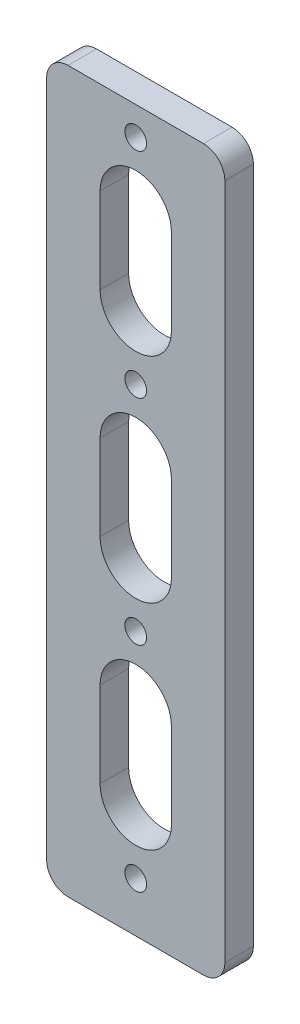
ISO-10303-21;
HEADER;
FILE_DESCRIPTION(('STEP AP214'),'2;1');
FILE_NAME('part.step','',(''),(''),'','','');
FILE_SCHEMA(('AUTOMOTIVE_DESIGN { 1 0 10303 214 1 1 1 1 }'));
ENDSEC;
DATA;
#1=APPLICATION_CONTEXT('core data for automotive mechanical design processes');
#2=APPLICATION_PROTOCOL_DEFINITION('international standard','automotive_design',2000,#1);
#3=PRODUCT_CONTEXT('',#1,'mechanical');
#4=PRODUCT('Part','Part','',(#3));
#5=PRODUCT_RELATED_PRODUCT_CATEGORY('part','',(#4));
#6=PRODUCT_DEFINITION_FORMATION('','',#4);
#7=PRODUCT_DEFINITION_CONTEXT('part definition',#1,'design');
#8=PRODUCT_DEFINITION('design','',#6,#7);
#9=PRODUCT_DEFINITION_SHAPE('','',#8);
#10=(LENGTH_UNIT() NAMED_UNIT(*) SI_UNIT(.MILLI.,.METRE.));
#11=(NAMED_UNIT(*) PLANE_ANGLE_UNIT() SI_UNIT($,.RADIAN.));
#12=(NAMED_UNIT(*) SI_UNIT($,.STERADIAN.) SOLID_ANGLE_UNIT());
#13=UNCERTAINTY_MEASURE_WITH_UNIT(LENGTH_MEASURE(1.E-05),#10,'distance_accuracy_value','');
#14=(GEOMETRIC_REPRESENTATION_CONTEXT(3) GLOBAL_UNCERTAINTY_ASSIGNED_CONTEXT((#13)) GLOBAL_UNIT_ASSIGNED_CONTEXT((#10,
#11,#12)) REPRESENTATION_CONTEXT('',''));
#15=CARTESIAN_POINT('',(0.,0.,0.));
#16=DIRECTION('',(0.,0.,1.));
#17=DIRECTION('',(1.,0.,0.));
#18=AXIS2_PLACEMENT_3D('',#15,#16,#17);
#19=CARTESIAN_POINT('',(12.5,-50.5,4.));
#20=DIRECTION('',(-1.,0.,0.));
#21=DIRECTION('',(0.,0.,1.));
#22=AXIS2_PLACEMENT_3D('',#19,#20,#21);
#23=PLANE('',#22);
#24=DIRECTION('',(0.,1.,0.));
#25=VECTOR('',#24,1.);
#26=CARTESIAN_POINT('',(12.5,-50.5,4.));
#27=LINE('',#26,#25);
#28=CARTESIAN_POINT('',(12.5,-47.5,4.));
#29=VERTEX_POINT('',#28);
#30=CARTESIAN_POINT('',(12.5,47.5,4.));
#31=VERTEX_POINT('',#30);
#32=EDGE_CURVE('E298',#29,#31,#27,.T.);
#33=ORIENTED_EDGE('',*,*,#32,.F.);
#34=DIRECTION('',(0.,0.,-1.));
#35=VECTOR('',#34,1.);
#36=CARTESIAN_POINT('',(12.5,-47.5,4.));
#37=LINE('',#36,#35);
#38=CARTESIAN_POINT('',(12.5,-47.5,0.));
#39=VERTEX_POINT('',#38);
#40=EDGE_CURVE('E323',#29,#39,#37,.T.);
#41=ORIENTED_EDGE('',*,*,#40,.T.);
#42=DIRECTION('',(0.,1.,0.));
#43=VECTOR('',#42,1.);
#44=CARTESIAN_POINT('',(12.5,-50.5,0.));
#45=LINE('',#44,#43);
#46=CARTESIAN_POINT('',(12.5,47.5,0.));
#47=VERTEX_POINT('',#46);
#48=EDGE_CURVE('E277',#39,#47,#45,.T.);
#49=ORIENTED_EDGE('',*,*,#48,.T.);
#50=DIRECTION('',(0.,0.,-1.));
#51=VECTOR('',#50,1.);
#52=CARTESIAN_POINT('',(12.5,47.5,4.));
#53=LINE('',#52,#51);
#54=EDGE_CURVE('E311',#47,#31,#53,.F.);
#55=ORIENTED_EDGE('',*,*,#54,.T.);
#56=EDGE_LOOP('',(#33,#41,#49,#55));
#57=FACE_BOUND('',#56,.T.);
#58=ADVANCED_FACE('F36',(#57),#23,.F.);
#59=CARTESIAN_POINT('',(-12.5,50.5,4.));
#60=DIRECTION('',(0.,-1.,0.));
#61=DIRECTION('',(0.,0.,-1.));
#62=AXIS2_PLACEMENT_3D('',#59,#60,#61);
#63=PLANE('',#62);
#64=DIRECTION('',(-1.,0.,0.));
#65=VECTOR('',#64,1.);
#66=CARTESIAN_POINT('',(-12.5,50.5,0.));
#67=LINE('',#66,#65);
#68=CARTESIAN_POINT('',(9.50000000000001,50.5,0.));
#69=VERTEX_POINT('',#68);
#70=CARTESIAN_POINT('',(-9.5,50.5,0.));
#71=VERTEX_POINT('',#70);
#72=EDGE_CURVE('E314',#69,#71,#67,.T.);
#73=ORIENTED_EDGE('',*,*,#72,.T.);
#74=DIRECTION('',(0.,0.,-1.));
#75=VECTOR('',#74,1.);
#76=CARTESIAN_POINT('',(-9.5,50.5,4.));
#77=LINE('',#76,#75);
#78=CARTESIAN_POINT('',(-9.5,50.5,4.));
#79=VERTEX_POINT('',#78);
#80=EDGE_CURVE('E11',#71,#79,#77,.F.);
#81=ORIENTED_EDGE('',*,*,#80,.T.);
#82=DIRECTION('',(-1.,0.,0.));
#83=VECTOR('',#82,1.);
#84=CARTESIAN_POINT('',(-12.5,50.5,4.));
#85=LINE('',#84,#83);
#86=CARTESIAN_POINT('',(9.50000000000001,50.5,4.));
#87=VERTEX_POINT('',#86);
#88=EDGE_CURVE('E301',#87,#79,#85,.T.);
#89=ORIENTED_EDGE('',*,*,#88,.F.);
#90=DIRECTION('',(0.,0.,-1.));
#91=VECTOR('',#90,1.);
#92=CARTESIAN_POINT('',(9.50000000000001,50.5,4.));
#93=LINE('',#92,#91);
#94=EDGE_CURVE('E44',#87,#69,#93,.T.);
#95=ORIENTED_EDGE('',*,*,#94,.T.);
#96=EDGE_LOOP('',(#73,#81,#89,#95));
#97=FACE_BOUND('',#96,.T.);
#98=ADVANCED_FACE('F356',(#97),#63,.F.);
#99=CARTESIAN_POINT('',(-12.5,-50.5,4.));
#100=DIRECTION('',(1.,0.,0.));
#101=DIRECTION('',(0.,0.,-1.));
#102=AXIS2_PLACEMENT_3D('',#99,#100,#101);
#103=PLANE('',#102);
#104=DIRECTION('',(0.,-1.,0.));
#105=VECTOR('',#104,1.);
#106=CARTESIAN_POINT('',(-12.5,-50.5,4.));
#107=LINE('',#106,#105);
#108=CARTESIAN_POINT('',(-12.5,47.5,4.));
#109=VERTEX_POINT('',#108);
#110=CARTESIAN_POINT('',(-12.5,-47.5,4.));
#111=VERTEX_POINT('',#110);
#112=EDGE_CURVE('E305',#109,#111,#107,.T.);
#113=ORIENTED_EDGE('',*,*,#112,.F.);
#114=DIRECTION('',(0.,0.,-1.));
#115=VECTOR('',#114,1.);
#116=CARTESIAN_POINT('',(-12.5,47.5,4.));
#117=LINE('',#116,#115);
#118=CARTESIAN_POINT('',(-12.5,47.5,0.));
#119=VERTEX_POINT('',#118);
#120=EDGE_CURVE('E349',#109,#119,#117,.T.);
#121=ORIENTED_EDGE('',*,*,#120,.T.);
#122=DIRECTION('',(0.,-1.,0.));
#123=VECTOR('',#122,1.);
#124=CARTESIAN_POINT('',(-12.5,-50.5,0.));
#125=LINE('',#124,#123);
#126=CARTESIAN_POINT('',(-12.5,-47.5,0.));
#127=VERTEX_POINT('',#126);
#128=EDGE_CURVE('E317',#119,#127,#125,.T.);
#129=ORIENTED_EDGE('',*,*,#128,.T.);
#130=DIRECTION('',(0.,0.,-1.));
#131=VECTOR('',#130,1.);
#132=CARTESIAN_POINT('',(-12.5,-47.5,4.));
#133=LINE('',#132,#131);
#134=EDGE_CURVE('E347',#127,#111,#133,.F.);
#135=ORIENTED_EDGE('',*,*,#134,.T.);
#136=EDGE_LOOP('',(#113,#121,#129,#135));
#137=FACE_BOUND('',#136,.T.);
#138=ADVANCED_FACE('F369',(#137),#103,.F.);
#139=CARTESIAN_POINT('',(-12.5,-50.5,4.));
#140=DIRECTION('',(0.,1.,0.));
#141=DIRECTION('',(0.,0.,1.));
#142=AXIS2_PLACEMENT_3D('',#139,#140,#141);
#143=PLANE('',#142);
#144=DIRECTION('',(1.,0.,0.));
#145=VECTOR('',#144,1.);
#146=CARTESIAN_POINT('',(-12.5,-50.5,0.));
#147=LINE('',#146,#145);
#148=CARTESIAN_POINT('',(-9.5,-50.5,0.));
#149=VERTEX_POINT('',#148);
#150=CARTESIAN_POINT('',(9.50000000000001,-50.5,0.));
#151=VERTEX_POINT('',#150);
#152=EDGE_CURVE('E302',#149,#151,#147,.T.);
#153=ORIENTED_EDGE('',*,*,#152,.T.);
#154=DIRECTION('',(0.,0.,-1.));
#155=VECTOR('',#154,1.);
#156=CARTESIAN_POINT('',(9.50000000000001,-50.5,4.));
#157=LINE('',#156,#155);
#158=CARTESIAN_POINT('',(9.50000000000001,-50.5,4.));
#159=VERTEX_POINT('',#158);
#160=EDGE_CURVE('E337',#151,#159,#157,.F.);
#161=ORIENTED_EDGE('',*,*,#160,.T.);
#162=DIRECTION('',(1.,0.,0.));
#163=VECTOR('',#162,1.);
#164=CARTESIAN_POINT('',(-12.5,-50.5,4.));
#165=LINE('',#164,#163);
#166=CARTESIAN_POINT('',(-9.5,-50.5,4.));
#167=VERTEX_POINT('',#166);
#168=EDGE_CURVE('E308',#167,#159,#165,.T.);
#169=ORIENTED_EDGE('',*,*,#168,.F.);
#170=DIRECTION('',(0.,0.,-1.));
#171=VECTOR('',#170,1.);
#172=CARTESIAN_POINT('',(-9.5,-50.5,4.));
#173=LINE('',#172,#171);
#174=EDGE_CURVE('E334',#167,#149,#173,.T.);
#175=ORIENTED_EDGE('',*,*,#174,.T.);
#176=EDGE_LOOP('',(#153,#161,#169,#175));
#177=FACE_BOUND('',#176,.T.);
#178=ADVANCED_FACE('F379',(#177),#143,.F.);
#179=CARTESIAN_POINT('',(0.,0.,4.));
#180=DIRECTION('',(0.,0.,-1.));
#181=DIRECTION('',(-1.,0.,0.));
#182=AXIS2_PLACEMENT_3D('',#179,#180,#181);
#183=PLANE('',#182);
#184=DIRECTION('',(0.,1.,0.));
#185=VECTOR('',#184,1.);
#186=CARTESIAN_POINT('',(5.,-34.5000000005128,4.));
#187=LINE('',#186,#185);
#188=CARTESIAN_POINT('',(5.,-34.5000000005128,4.));
#189=VERTEX_POINT('',#188);
#190=CARTESIAN_POINT('',(5.,-22.5000000005128,4.));
#191=VERTEX_POINT('',#190);
#192=EDGE_CURVE('E202',#189,#191,#187,.T.);
#193=ORIENTED_EDGE('',*,*,#192,.F.);
#194=CARTESIAN_POINT('',(0.,-34.5000000005128,4.));
#195=DIRECTION('',(0.,0.,1.));
#196=DIRECTION('',(1.,0.,0.));
#197=AXIS2_PLACEMENT_3D('',#194,#195,#196);
#198=CIRCLE('',#197,5.);
#199=CARTESIAN_POINT('',(-5.,-34.5000000005128,4.));
#200=VERTEX_POINT('',#199);
#201=EDGE_CURVE('E51',#200,#189,#198,.T.);
#202=ORIENTED_EDGE('',*,*,#201,.F.);
#203=DIRECTION('',(0.,-1.,0.));
#204=VECTOR('',#203,1.);
#205=CARTESIAN_POINT('',(-5.,-34.5000000005128,4.));
#206=LINE('',#205,#204);
#207=CARTESIAN_POINT('',(-5.,-22.5000000005128,4.));
#208=VERTEX_POINT('',#207);
#209=EDGE_CURVE('E193',#208,#200,#206,.T.);
#210=ORIENTED_EDGE('',*,*,#209,.F.);
#211=CARTESIAN_POINT('',(0.,-22.5000000005128,4.));
#212=DIRECTION('',(0.,0.,1.));
#213=DIRECTION('',(1.,0.,0.));
#214=AXIS2_PLACEMENT_3D('',#211,#212,#213);
#215=CIRCLE('',#214,5.);
#216=EDGE_CURVE('E196',#191,#208,#215,.T.);
#217=ORIENTED_EDGE('',*,*,#216,.F.);
#218=EDGE_LOOP('',(#193,#202,#210,#217));
#219=FACE_BOUND('',#218,.T.);
#220=DIRECTION('',(0.,1.,0.));
#221=VECTOR('',#220,1.);
#222=CARTESIAN_POINT('',(4.99999999999999,-4.50000000051281,4.));
#223=LINE('',#222,#221);
#224=CARTESIAN_POINT('',(4.99999999999999,-4.50000000051281,4.));
#225=VERTEX_POINT('',#224);
#226=CARTESIAN_POINT('',(5.,7.49999999948719,4.));
#227=VERTEX_POINT('',#226);
#228=EDGE_CURVE('E228',#225,#227,#223,.T.);
#229=ORIENTED_EDGE('',*,*,#228,.F.);
#230=CARTESIAN_POINT('',(0.,-4.50000000051281,4.));
#231=DIRECTION('',(0.,0.,1.));
#232=DIRECTION('',(1.,0.,0.));
#233=AXIS2_PLACEMENT_3D('',#230,#231,#232);
#234=CIRCLE('',#233,4.99999999999999);
#235=CARTESIAN_POINT('',(-4.99999999999999,-4.5000000005128,4.));
#236=VERTEX_POINT('',#235);
#237=EDGE_CURVE('E59',#236,#225,#234,.T.);
#238=ORIENTED_EDGE('',*,*,#237,.F.);
#239=DIRECTION('',(0.,-1.,0.));
#240=VECTOR('',#239,1.);
#241=CARTESIAN_POINT('',(-4.99999999999999,-4.5000000005128,4.));
#242=LINE('',#241,#240);
#243=CARTESIAN_POINT('',(-4.99999999999999,7.49999999948719,4.));
#244=VERTEX_POINT('',#243);
#245=EDGE_CURVE('E217',#244,#236,#242,.T.);
#246=ORIENTED_EDGE('',*,*,#245,.F.);
#247=CARTESIAN_POINT('',(0.,7.49999999948719,4.));
#248=DIRECTION('',(0.,0.,1.));
#249=DIRECTION('',(1.,0.,0.));
#250=AXIS2_PLACEMENT_3D('',#247,#248,#249);
#251=CIRCLE('',#250,4.99999999999999);
#252=EDGE_CURVE('E232',#227,#244,#251,.T.);
#253=ORIENTED_EDGE('',*,*,#252,.F.);
#254=EDGE_LOOP('',(#229,#238,#246,#253));
#255=FACE_BOUND('',#254,.T.);
#256=DIRECTION('',(0.,1.,0.));
#257=VECTOR('',#256,1.);
#258=CARTESIAN_POINT('',(5.,25.4999999994872,4.));
#259=LINE('',#258,#257);
#260=CARTESIAN_POINT('',(5.,25.4999999994872,4.));
#261=VERTEX_POINT('',#260);
#262=CARTESIAN_POINT('',(5.,37.4999999994872,4.));
#263=VERTEX_POINT('',#262);
#264=EDGE_CURVE('E259',#261,#263,#259,.T.);
#265=ORIENTED_EDGE('',*,*,#264,.F.);
#266=CARTESIAN_POINT('',(0.,25.4999999994872,4.));
#267=DIRECTION('',(0.,0.,1.));
#268=DIRECTION('',(1.,0.,0.));
#269=AXIS2_PLACEMENT_3D('',#266,#267,#268);
#270=CIRCLE('',#269,5.);
#271=CARTESIAN_POINT('',(-5.,25.4999999994872,4.));
#272=VERTEX_POINT('',#271);
#273=EDGE_CURVE('E257',#272,#261,#270,.T.);
#274=ORIENTED_EDGE('',*,*,#273,.F.);
#275=DIRECTION('',(0.,-1.,0.));
#276=VECTOR('',#275,1.);
#277=CARTESIAN_POINT('',(-5.,25.4999999994872,4.));
#278=LINE('',#277,#276);
#279=CARTESIAN_POINT('',(-5.,37.4999999994872,4.));
#280=VERTEX_POINT('',#279);
#281=EDGE_CURVE('E247',#280,#272,#278,.T.);
#282=ORIENTED_EDGE('',*,*,#281,.F.);
#283=CARTESIAN_POINT('',(0.,37.4999999994872,4.));
#284=DIRECTION('',(0.,0.,1.));
#285=DIRECTION('',(1.,0.,0.));
#286=AXIS2_PLACEMENT_3D('',#283,#284,#285);
#287=CIRCLE('',#286,5.);
#288=EDGE_CURVE('E262',#263,#280,#287,.T.);
#289=ORIENTED_EDGE('',*,*,#288,.F.);
#290=EDGE_LOOP('',(#265,#274,#282,#289));
#291=FACE_BOUND('',#290,.T.);
#292=CARTESIAN_POINT('',(-2.54758864111428E-12,-43.5000000005128,4.));
#293=DIRECTION('',(0.,0.,-1.));
#294=DIRECTION('',(-1.,0.,0.));
#295=AXIS2_PLACEMENT_3D('',#292,#293,#294);
#296=CIRCLE('',#295,1.52500000048909);
#297=CARTESIAN_POINT('',(-1.52500000049164,-43.5000000005128,4.));
#298=VERTEX_POINT('',#297);
#299=EDGE_CURVE('E274',#298,#298,#296,.T.);
#300=ORIENTED_EDGE('',*,*,#299,.T.);
#301=EDGE_LOOP('',(#300));
#302=FACE_BOUND('',#301,.T.);
#303=CARTESIAN_POINT('',(-2.54438264456998E-12,-13.5000000005128,4.));
#304=DIRECTION('',(0.,0.,-1.));
#305=DIRECTION('',(-1.,0.,0.));
#306=AXIS2_PLACEMENT_3D('',#303,#304,#305);
#307=CIRCLE('',#306,1.5250000004891);
#308=CARTESIAN_POINT('',(-1.52500000049164,-13.5000000005128,4.));
#309=VERTEX_POINT('',#308);
#310=EDGE_CURVE('E281',#309,#309,#307,.T.);
#311=ORIENTED_EDGE('',*,*,#310,.T.);
#312=EDGE_LOOP('',(#311));
#313=FACE_BOUND('',#312,.T.);
#314=CARTESIAN_POINT('',(-2.54117664802568E-12,16.4999999994872,4.));
#315=DIRECTION('',(0.,0.,-1.));
#316=DIRECTION('',(-1.,0.,0.));
#317=AXIS2_PLACEMENT_3D('',#314,#315,#316);
#318=CIRCLE('',#317,1.5250000004891);
#319=CARTESIAN_POINT('',(-1.52500000049164,16.4999999994872,4.));
#320=VERTEX_POINT('',#319);
#321=EDGE_CURVE('E287',#320,#320,#318,.T.);
#322=ORIENTED_EDGE('',*,*,#321,.T.);
#323=EDGE_LOOP('',(#322));
#324=FACE_BOUND('',#323,.T.);
#325=CARTESIAN_POINT('',(-2.53797065148138E-12,46.4999999994872,4.));
#326=DIRECTION('',(0.,0.,-1.));
#327=DIRECTION('',(-1.,0.,0.));
#328=AXIS2_PLACEMENT_3D('',#325,#326,#327);
#329=CIRCLE('',#328,1.52500000048909);
#330=CARTESIAN_POINT('',(-1.52500000049163,46.4999999994872,4.));
#331=VERTEX_POINT('',#330);
#332=EDGE_CURVE('E293',#331,#331,#329,.T.);
#333=ORIENTED_EDGE('',*,*,#332,.T.);
#334=EDGE_LOOP('',(#333));
#335=FACE_BOUND('',#334,.T.);
#336=ORIENTED_EDGE('',*,*,#168,.T.);
#337=CARTESIAN_POINT('',(9.50000000000001,-47.5,4.));
#338=DIRECTION('',(0.,0.,-1.));
#339=DIRECTION('',(-1.,0.,0.));
#340=AXIS2_PLACEMENT_3D('',#337,#338,#339);
#341=CIRCLE('',#340,3.);
#342=EDGE_CURVE('E345',#159,#29,#341,.F.);
#343=ORIENTED_EDGE('',*,*,#342,.T.);
#344=ORIENTED_EDGE('',*,*,#32,.T.);
#345=CARTESIAN_POINT('',(9.50000000000001,47.5,4.));
#346=DIRECTION('',(0.,0.,-1.));
#347=DIRECTION('',(-1.,0.,0.));
#348=AXIS2_PLACEMENT_3D('',#345,#346,#347);
#349=CIRCLE('',#348,3.);
#350=EDGE_CURVE('E341',#31,#87,#349,.F.);
#351=ORIENTED_EDGE('',*,*,#350,.T.);
#352=ORIENTED_EDGE('',*,*,#88,.T.);
#353=CARTESIAN_POINT('',(-9.5,47.5,4.));
#354=DIRECTION('',(0.,0.,-1.));
#355=DIRECTION('',(-1.,0.,0.));
#356=AXIS2_PLACEMENT_3D('',#353,#354,#355);
#357=CIRCLE('',#356,3.);
#358=EDGE_CURVE('E343',#79,#109,#357,.F.);
#359=ORIENTED_EDGE('',*,*,#358,.T.);
#360=ORIENTED_EDGE('',*,*,#112,.T.);
#361=CARTESIAN_POINT('',(-9.5,-47.5,4.));
#362=DIRECTION('',(0.,0.,-1.));
#363=DIRECTION('',(-1.,0.,0.));
#364=AXIS2_PLACEMENT_3D('',#361,#362,#363);
#365=CIRCLE('',#364,3.);
#366=EDGE_CURVE('E339',#111,#167,#365,.F.);
#367=ORIENTED_EDGE('',*,*,#366,.T.);
#368=EDGE_LOOP('',(#336,#343,#344,#351,#352,#359,#360,#367));
#369=FACE_BOUND('',#368,.T.);
#370=ADVANCED_FACE('F373',(#219,#255,#291,#302,#313,#324,#335,#369),#183,.F.);
#371=CARTESIAN_POINT('',(0.,0.,0.));
#372=DIRECTION('',(0.,0.,-1.));
#373=DIRECTION('',(-1.,0.,0.));
#374=AXIS2_PLACEMENT_3D('',#371,#372,#373);
#375=PLANE('',#374);
#376=CARTESIAN_POINT('',(0.,-34.5000000005128,0.));
#377=DIRECTION('',(0.,0.,1.));
#378=DIRECTION('',(1.,0.,0.));
#379=AXIS2_PLACEMENT_3D('',#376,#377,#378);
#380=CIRCLE('',#379,5.);
#381=CARTESIAN_POINT('',(-5.,-34.5000000005128,0.));
#382=VERTEX_POINT('',#381);
#383=CARTESIAN_POINT('',(5.,-34.5000000005128,0.));
#384=VERTEX_POINT('',#383);
#385=EDGE_CURVE('E174',#382,#384,#380,.T.);
#386=ORIENTED_EDGE('',*,*,#385,.T.);
#387=DIRECTION('',(0.,1.,0.));
#388=VECTOR('',#387,1.);
#389=CARTESIAN_POINT('',(5.,-34.5000000005128,0.));
#390=LINE('',#389,#388);
#391=CARTESIAN_POINT('',(4.99999999999999,-22.5000000005128,0.));
#392=VERTEX_POINT('',#391);
#393=EDGE_CURVE('E184',#384,#392,#390,.T.);
#394=ORIENTED_EDGE('',*,*,#393,.T.);
#395=CARTESIAN_POINT('',(0.,-22.5000000005128,0.));
#396=DIRECTION('',(0.,0.,1.));
#397=DIRECTION('',(1.,0.,0.));
#398=AXIS2_PLACEMENT_3D('',#395,#396,#397);
#399=CIRCLE('',#398,5.);
#400=CARTESIAN_POINT('',(-5.,-22.5000000005128,0.));
#401=VERTEX_POINT('',#400);
#402=EDGE_CURVE('E188',#392,#401,#399,.T.);
#403=ORIENTED_EDGE('',*,*,#402,.T.);
#404=DIRECTION('',(0.,-1.,0.));
#405=VECTOR('',#404,1.);
#406=CARTESIAN_POINT('',(-5.,-34.5000000005128,0.));
#407=LINE('',#406,#405);
#408=EDGE_CURVE('E180',#401,#382,#407,.T.);
#409=ORIENTED_EDGE('',*,*,#408,.T.);
#410=EDGE_LOOP('',(#386,#394,#403,#409));
#411=FACE_BOUND('',#410,.T.);
#412=CARTESIAN_POINT('',(0.,-4.50000000051281,0.));
#413=DIRECTION('',(0.,0.,1.));
#414=DIRECTION('',(1.,0.,0.));
#415=AXIS2_PLACEMENT_3D('',#412,#413,#414);
#416=CIRCLE('',#415,4.99999999999999);
#417=CARTESIAN_POINT('',(-4.99999999999999,-4.5000000005128,0.));
#418=VERTEX_POINT('',#417);
#419=CARTESIAN_POINT('',(4.99999999999999,-4.50000000051281,0.));
#420=VERTEX_POINT('',#419);
#421=EDGE_CURVE('E213',#418,#420,#416,.T.);
#422=ORIENTED_EDGE('',*,*,#421,.T.);
#423=DIRECTION('',(0.,1.,0.));
#424=VECTOR('',#423,1.);
#425=CARTESIAN_POINT('',(4.99999999999999,-4.50000000051281,0.));
#426=LINE('',#425,#424);
#427=CARTESIAN_POINT('',(4.99999999999999,7.49999999948719,0.));
#428=VERTEX_POINT('',#427);
#429=EDGE_CURVE('E216',#420,#428,#426,.T.);
#430=ORIENTED_EDGE('',*,*,#429,.T.);
#431=CARTESIAN_POINT('',(0.,7.49999999948719,0.));
#432=DIRECTION('',(0.,0.,1.));
#433=DIRECTION('',(1.,0.,0.));
#434=AXIS2_PLACEMENT_3D('',#431,#432,#433);
#435=CIRCLE('',#434,4.99999999999999);
#436=CARTESIAN_POINT('',(-4.99999999999999,7.49999999948719,0.));
#437=VERTEX_POINT('',#436);
#438=EDGE_CURVE('E220',#428,#437,#435,.T.);
#439=ORIENTED_EDGE('',*,*,#438,.T.);
#440=DIRECTION('',(0.,-1.,0.));
#441=VECTOR('',#440,1.);
#442=CARTESIAN_POINT('',(-4.99999999999999,-4.5000000005128,0.));
#443=LINE('',#442,#441);
#444=EDGE_CURVE('E223',#437,#418,#443,.T.);
#445=ORIENTED_EDGE('',*,*,#444,.T.);
#446=EDGE_LOOP('',(#422,#430,#439,#445));
#447=FACE_BOUND('',#446,.T.);
#448=CARTESIAN_POINT('',(0.,25.4999999994872,0.));
#449=DIRECTION('',(0.,0.,1.));
#450=DIRECTION('',(1.,0.,0.));
#451=AXIS2_PLACEMENT_3D('',#448,#449,#450);
#452=CIRCLE('',#451,5.);
#453=CARTESIAN_POINT('',(-5.,25.4999999994872,0.));
#454=VERTEX_POINT('',#453);
#455=CARTESIAN_POINT('',(5.,25.4999999994872,0.));
#456=VERTEX_POINT('',#455);
#457=EDGE_CURVE('E243',#454,#456,#452,.T.);
#458=ORIENTED_EDGE('',*,*,#457,.T.);
#459=DIRECTION('',(0.,1.,0.));
#460=VECTOR('',#459,1.);
#461=CARTESIAN_POINT('',(5.,25.4999999994872,0.));
#462=LINE('',#461,#460);
#463=CARTESIAN_POINT('',(5.,37.4999999994872,0.));
#464=VERTEX_POINT('',#463);
#465=EDGE_CURVE('E246',#456,#464,#462,.T.);
#466=ORIENTED_EDGE('',*,*,#465,.T.);
#467=CARTESIAN_POINT('',(0.,37.4999999994872,0.));
#468=DIRECTION('',(0.,0.,1.));
#469=DIRECTION('',(1.,0.,0.));
#470=AXIS2_PLACEMENT_3D('',#467,#468,#469);
#471=CIRCLE('',#470,5.);
#472=CARTESIAN_POINT('',(-5.,37.4999999994872,0.));
#473=VERTEX_POINT('',#472);
#474=EDGE_CURVE('E250',#464,#473,#471,.T.);
#475=ORIENTED_EDGE('',*,*,#474,.T.);
#476=DIRECTION('',(0.,-1.,0.));
#477=VECTOR('',#476,1.);
#478=CARTESIAN_POINT('',(-5.,25.4999999994872,0.));
#479=LINE('',#478,#477);
#480=EDGE_CURVE('E253',#473,#454,#479,.T.);
#481=ORIENTED_EDGE('',*,*,#480,.T.);
#482=EDGE_LOOP('',(#458,#466,#475,#481));
#483=FACE_BOUND('',#482,.T.);
#484=CARTESIAN_POINT('',(-2.54758864111428E-12,-43.5000000005128,0.));
#485=DIRECTION('',(0.,0.,-1.));
#486=DIRECTION('',(-1.,0.,0.));
#487=AXIS2_PLACEMENT_3D('',#484,#485,#486);
#488=CIRCLE('',#487,1.52500000048909);
#489=CARTESIAN_POINT('',(-1.52500000049164,-43.5000000005128,0.));
#490=VERTEX_POINT('',#489);
#491=EDGE_CURVE('E278',#490,#490,#488,.T.);
#492=ORIENTED_EDGE('',*,*,#491,.F.);
#493=EDGE_LOOP('',(#492));
#494=FACE_BOUND('',#493,.T.);
#495=CARTESIAN_POINT('',(-2.54438264456998E-12,-13.5000000005128,0.));
#496=DIRECTION('',(0.,0.,-1.));
#497=DIRECTION('',(-1.,0.,0.));
#498=AXIS2_PLACEMENT_3D('',#495,#496,#497);
#499=CIRCLE('',#498,1.5250000004891);
#500=CARTESIAN_POINT('',(-1.52500000049164,-13.5000000005128,0.));
#501=VERTEX_POINT('',#500);
#502=EDGE_CURVE('E284',#501,#501,#499,.T.);
#503=ORIENTED_EDGE('',*,*,#502,.F.);
#504=EDGE_LOOP('',(#503));
#505=FACE_BOUND('',#504,.T.);
#506=CARTESIAN_POINT('',(-2.54117664802568E-12,16.4999999994872,0.));
#507=DIRECTION('',(0.,0.,-1.));
#508=DIRECTION('',(-1.,0.,0.));
#509=AXIS2_PLACEMENT_3D('',#506,#507,#508);
#510=CIRCLE('',#509,1.5250000004891);
#511=CARTESIAN_POINT('',(-1.52500000049164,16.4999999994872,0.));
#512=VERTEX_POINT('',#511);
#513=EDGE_CURVE('E290',#512,#512,#510,.T.);
#514=ORIENTED_EDGE('',*,*,#513,.F.);
#515=EDGE_LOOP('',(#514));
#516=FACE_BOUND('',#515,.T.);
#517=CARTESIAN_POINT('',(-2.53797065148138E-12,46.4999999994872,0.));
#518=DIRECTION('',(0.,0.,-1.));
#519=DIRECTION('',(-1.,0.,0.));
#520=AXIS2_PLACEMENT_3D('',#517,#518,#519);
#521=CIRCLE('',#520,1.52500000048909);
#522=CARTESIAN_POINT('',(-1.52500000049163,46.4999999994872,0.));
#523=VERTEX_POINT('',#522);
#524=EDGE_CURVE('E209',#523,#523,#521,.T.);
#525=ORIENTED_EDGE('',*,*,#524,.F.);
#526=EDGE_LOOP('',(#525));
#527=FACE_BOUND('',#526,.T.);
#528=ORIENTED_EDGE('',*,*,#48,.F.);
#529=CARTESIAN_POINT('',(9.50000000000001,-47.5,0.));
#530=DIRECTION('',(0.,0.,-1.));
#531=DIRECTION('',(-1.,0.,0.));
#532=AXIS2_PLACEMENT_3D('',#529,#530,#531);
#533=CIRCLE('',#532,3.);
#534=EDGE_CURVE('E332',#39,#151,#533,.T.);
#535=ORIENTED_EDGE('',*,*,#534,.T.);
#536=ORIENTED_EDGE('',*,*,#152,.F.);
#537=CARTESIAN_POINT('',(-9.5,-47.5,0.));
#538=DIRECTION('',(0.,0.,-1.));
#539=DIRECTION('',(-1.,0.,0.));
#540=AXIS2_PLACEMENT_3D('',#537,#538,#539);
#541=CIRCLE('',#540,3.);
#542=EDGE_CURVE('E326',#149,#127,#541,.T.);
#543=ORIENTED_EDGE('',*,*,#542,.T.);
#544=ORIENTED_EDGE('',*,*,#128,.F.);
#545=CARTESIAN_POINT('',(-9.5,47.5,0.));
#546=DIRECTION('',(0.,0.,-1.));
#547=DIRECTION('',(-1.,0.,0.));
#548=AXIS2_PLACEMENT_3D('',#545,#546,#547);
#549=CIRCLE('',#548,3.);
#550=EDGE_CURVE('E330',#119,#71,#549,.T.);
#551=ORIENTED_EDGE('',*,*,#550,.T.);
#552=ORIENTED_EDGE('',*,*,#72,.F.);
#553=CARTESIAN_POINT('',(9.50000000000001,47.5,0.));
#554=DIRECTION('',(0.,0.,-1.));
#555=DIRECTION('',(-1.,0.,0.));
#556=AXIS2_PLACEMENT_3D('',#553,#554,#555);
#557=CIRCLE('',#556,3.);
#558=EDGE_CURVE('E328',#69,#47,#557,.T.);
#559=ORIENTED_EDGE('',*,*,#558,.T.);
#560=EDGE_LOOP('',(#528,#535,#536,#543,#544,#551,#552,#559));
#561=FACE_BOUND('',#560,.T.);
#562=ADVANCED_FACE('F190',(#411,#447,#483,#494,#505,#516,#527,#561),#375,.T.);
#563=CARTESIAN_POINT('',(-2.53797065148138E-12,46.4999999994872,4.));
#564=DIRECTION('',(0.,0.,-1.));
#565=DIRECTION('',(-1.,0.,0.));
#566=AXIS2_PLACEMENT_3D('',#563,#564,#565);
#567=CYLINDRICAL_SURFACE('',#566,1.52500000048909);
#568=ORIENTED_EDGE('',*,*,#332,.F.);
#569=EDGE_LOOP('',(#568));
#570=FACE_BOUND('',#569,.T.);
#571=ORIENTED_EDGE('',*,*,#524,.T.);
#572=EDGE_LOOP('',(#571));
#573=FACE_BOUND('',#572,.T.);
#574=ADVANCED_FACE('F425',(#570,#573),#567,.F.);
#575=CARTESIAN_POINT('',(-2.54117664802568E-12,16.4999999994872,4.));
#576=DIRECTION('',(0.,0.,-1.));
#577=DIRECTION('',(-1.,0.,0.));
#578=AXIS2_PLACEMENT_3D('',#575,#576,#577);
#579=CYLINDRICAL_SURFACE('',#578,1.5250000004891);
#580=ORIENTED_EDGE('',*,*,#321,.F.);
#581=EDGE_LOOP('',(#580));
#582=FACE_BOUND('',#581,.T.);
#583=ORIENTED_EDGE('',*,*,#513,.T.);
#584=EDGE_LOOP('',(#583));
#585=FACE_BOUND('',#584,.T.);
#586=ADVANCED_FACE('F415',(#582,#585),#579,.F.);
#587=CARTESIAN_POINT('',(-2.54438264456998E-12,-13.5000000005128,4.));
#588=DIRECTION('',(0.,0.,-1.));
#589=DIRECTION('',(-1.,0.,0.));
#590=AXIS2_PLACEMENT_3D('',#587,#588,#589);
#591=CYLINDRICAL_SURFACE('',#590,1.5250000004891);
#592=ORIENTED_EDGE('',*,*,#310,.F.);
#593=EDGE_LOOP('',(#592));
#594=FACE_BOUND('',#593,.T.);
#595=ORIENTED_EDGE('',*,*,#502,.T.);
#596=EDGE_LOOP('',(#595));
#597=FACE_BOUND('',#596,.T.);
#598=ADVANCED_FACE('F409',(#594,#597),#591,.F.);
#599=CARTESIAN_POINT('',(-2.54758864111428E-12,-43.5000000005128,4.));
#600=DIRECTION('',(0.,0.,-1.));
#601=DIRECTION('',(-1.,0.,0.));
#602=AXIS2_PLACEMENT_3D('',#599,#600,#601);
#603=CYLINDRICAL_SURFACE('',#602,1.52500000048909);
#604=ORIENTED_EDGE('',*,*,#299,.F.);
#605=EDGE_LOOP('',(#604));
#606=FACE_BOUND('',#605,.T.);
#607=ORIENTED_EDGE('',*,*,#491,.T.);
#608=EDGE_LOOP('',(#607));
#609=FACE_BOUND('',#608,.T.);
#610=ADVANCED_FACE('F405',(#606,#609),#603,.F.);
#611=CARTESIAN_POINT('',(9.50000000000001,-47.5,4.));
#612=DIRECTION('',(0.,0.,-1.));
#613=DIRECTION('',(-1.,0.,0.));
#614=AXIS2_PLACEMENT_3D('',#611,#612,#613);
#615=CYLINDRICAL_SURFACE('',#614,3.);
#616=ORIENTED_EDGE('',*,*,#342,.F.);
#617=ORIENTED_EDGE('',*,*,#160,.F.);
#618=ORIENTED_EDGE('',*,*,#534,.F.);
#619=ORIENTED_EDGE('',*,*,#40,.F.);
#620=EDGE_LOOP('',(#616,#617,#618,#619));
#621=FACE_BOUND('',#620,.T.);
#622=ADVANCED_FACE('F384',(#621),#615,.T.);
#623=CARTESIAN_POINT('',(-9.5,47.5,4.));
#624=DIRECTION('',(0.,0.,-1.));
#625=DIRECTION('',(-1.,0.,0.));
#626=AXIS2_PLACEMENT_3D('',#623,#624,#625);
#627=CYLINDRICAL_SURFACE('',#626,3.);
#628=ORIENTED_EDGE('',*,*,#358,.F.);
#629=ORIENTED_EDGE('',*,*,#80,.F.);
#630=ORIENTED_EDGE('',*,*,#550,.F.);
#631=ORIENTED_EDGE('',*,*,#120,.F.);
#632=EDGE_LOOP('',(#628,#629,#630,#631));
#633=FACE_BOUND('',#632,.T.);
#634=ADVANCED_FACE('F366',(#633),#627,.T.);
#635=CARTESIAN_POINT('',(9.50000000000001,47.5,4.));
#636=DIRECTION('',(0.,0.,-1.));
#637=DIRECTION('',(-1.,0.,0.));
#638=AXIS2_PLACEMENT_3D('',#635,#636,#637);
#639=CYLINDRICAL_SURFACE('',#638,3.);
#640=ORIENTED_EDGE('',*,*,#350,.F.);
#641=ORIENTED_EDGE('',*,*,#54,.F.);
#642=ORIENTED_EDGE('',*,*,#558,.F.);
#643=ORIENTED_EDGE('',*,*,#94,.F.);
#644=EDGE_LOOP('',(#640,#641,#642,#643));
#645=FACE_BOUND('',#644,.T.);
#646=ADVANCED_FACE('F388',(#645),#639,.T.);
#647=CARTESIAN_POINT('',(-9.5,-47.5,4.));
#648=DIRECTION('',(0.,0.,-1.));
#649=DIRECTION('',(-1.,0.,0.));
#650=AXIS2_PLACEMENT_3D('',#647,#648,#649);
#651=CYLINDRICAL_SURFACE('',#650,3.);
#652=ORIENTED_EDGE('',*,*,#366,.F.);
#653=ORIENTED_EDGE('',*,*,#134,.F.);
#654=ORIENTED_EDGE('',*,*,#542,.F.);
#655=ORIENTED_EDGE('',*,*,#174,.F.);
#656=EDGE_LOOP('',(#652,#653,#654,#655));
#657=FACE_BOUND('',#656,.T.);
#658=ADVANCED_FACE('F38',(#657),#651,.T.);
#659=CARTESIAN_POINT('',(0.,25.4999999994872,0.));
#660=DIRECTION('',(0.,0.,1.));
#661=DIRECTION('',(1.,0.,0.));
#662=AXIS2_PLACEMENT_3D('',#659,#660,#661);
#663=CYLINDRICAL_SURFACE('',#662,5.);
#664=ORIENTED_EDGE('',*,*,#273,.T.);
#665=DIRECTION('',(0.,0.,1.));
#666=VECTOR('',#665,1.);
#667=CARTESIAN_POINT('',(5.,25.4999999994872,0.));
#668=LINE('',#667,#666);
#669=EDGE_CURVE('E256',#456,#261,#668,.T.);
#670=ORIENTED_EDGE('',*,*,#669,.F.);
#671=ORIENTED_EDGE('',*,*,#457,.F.);
#672=DIRECTION('',(0.,0.,1.));
#673=VECTOR('',#672,1.);
#674=CARTESIAN_POINT('',(-5.,25.4999999994872,0.));
#675=LINE('',#674,#673);
#676=EDGE_CURVE('E229',#454,#272,#675,.T.);
#677=ORIENTED_EDGE('',*,*,#676,.T.);
#678=EDGE_LOOP('',(#664,#670,#671,#677));
#679=FACE_BOUND('',#678,.T.);
#680=ADVANCED_FACE('F394',(#679),#663,.F.);
#681=CARTESIAN_POINT('',(-5.,25.4999999994872,0.));
#682=DIRECTION('',(-1.,0.,0.));
#683=DIRECTION('',(0.,-1.,0.));
#684=AXIS2_PLACEMENT_3D('',#681,#682,#683);
#685=PLANE('',#684);
#686=ORIENTED_EDGE('',*,*,#281,.T.);
#687=ORIENTED_EDGE('',*,*,#676,.F.);
#688=ORIENTED_EDGE('',*,*,#480,.F.);
#689=DIRECTION('',(0.,0.,1.));
#690=VECTOR('',#689,1.);
#691=CARTESIAN_POINT('',(-5.,37.4999999994872,0.));
#692=LINE('',#691,#690);
#693=EDGE_CURVE('E268',#473,#280,#692,.T.);
#694=ORIENTED_EDGE('',*,*,#693,.T.);
#695=EDGE_LOOP('',(#686,#687,#688,#694));
#696=FACE_BOUND('',#695,.T.);
#697=ADVANCED_FACE('F517',(#696),#685,.F.);
#698=CARTESIAN_POINT('',(0.,37.4999999994872,0.));
#699=DIRECTION('',(0.,0.,1.));
#700=DIRECTION('',(1.,0.,0.));
#701=AXIS2_PLACEMENT_3D('',#698,#699,#700);
#702=CYLINDRICAL_SURFACE('',#701,5.);
#703=ORIENTED_EDGE('',*,*,#288,.T.);
#704=ORIENTED_EDGE('',*,*,#693,.F.);
#705=ORIENTED_EDGE('',*,*,#474,.F.);
#706=DIRECTION('',(0.,0.,1.));
#707=VECTOR('',#706,1.);
#708=CARTESIAN_POINT('',(5.,37.4999999994872,0.));
#709=LINE('',#708,#707);
#710=EDGE_CURVE('E270',#464,#263,#709,.T.);
#711=ORIENTED_EDGE('',*,*,#710,.T.);
#712=EDGE_LOOP('',(#703,#704,#705,#711));
#713=FACE_BOUND('',#712,.T.);
#714=ADVANCED_FACE('F525',(#713),#702,.F.);
#715=CARTESIAN_POINT('',(5.,25.4999999994872,0.));
#716=DIRECTION('',(1.,0.,0.));
#717=DIRECTION('',(0.,1.,0.));
#718=AXIS2_PLACEMENT_3D('',#715,#716,#717);
#719=PLANE('',#718);
#720=ORIENTED_EDGE('',*,*,#264,.T.);
#721=ORIENTED_EDGE('',*,*,#710,.F.);
#722=ORIENTED_EDGE('',*,*,#465,.F.);
#723=ORIENTED_EDGE('',*,*,#669,.T.);
#724=EDGE_LOOP('',(#720,#721,#722,#723));
#725=FACE_BOUND('',#724,.T.);
#726=ADVANCED_FACE('F534',(#725),#719,.F.);
#727=CARTESIAN_POINT('',(0.,-4.50000000051281,0.));
#728=DIRECTION('',(0.,0.,1.));
#729=DIRECTION('',(1.,0.,0.));
#730=AXIS2_PLACEMENT_3D('',#727,#728,#729);
#731=CYLINDRICAL_SURFACE('',#730,4.99999999999999);
#732=ORIENTED_EDGE('',*,*,#237,.T.);
#733=DIRECTION('',(0.,0.,1.));
#734=VECTOR('',#733,1.);
#735=CARTESIAN_POINT('',(4.99999999999999,-4.50000000051281,0.));
#736=LINE('',#735,#734);
#737=EDGE_CURVE('E226',#420,#225,#736,.T.);
#738=ORIENTED_EDGE('',*,*,#737,.F.);
#739=ORIENTED_EDGE('',*,*,#421,.F.);
#740=DIRECTION('',(0.,0.,1.));
#741=VECTOR('',#740,1.);
#742=CARTESIAN_POINT('',(-4.99999999999999,-4.5000000005128,0.));
#743=LINE('',#742,#741);
#744=EDGE_CURVE('E203',#418,#236,#743,.T.);
#745=ORIENTED_EDGE('',*,*,#744,.T.);
#746=EDGE_LOOP('',(#732,#738,#739,#745));
#747=FACE_BOUND('',#746,.T.);
#748=ADVANCED_FACE('F543',(#747),#731,.F.);
#749=CARTESIAN_POINT('',(-4.99999999999999,-4.5000000005128,0.));
#750=DIRECTION('',(-1.,0.,0.));
#751=DIRECTION('',(0.,-1.,0.));
#752=AXIS2_PLACEMENT_3D('',#749,#750,#751);
#753=PLANE('',#752);
#754=ORIENTED_EDGE('',*,*,#245,.T.);
#755=ORIENTED_EDGE('',*,*,#744,.F.);
#756=ORIENTED_EDGE('',*,*,#444,.F.);
#757=DIRECTION('',(0.,0.,1.));
#758=VECTOR('',#757,1.);
#759=CARTESIAN_POINT('',(-4.99999999999999,7.49999999948719,0.));
#760=LINE('',#759,#758);
#761=EDGE_CURVE('E238',#437,#244,#760,.T.);
#762=ORIENTED_EDGE('',*,*,#761,.T.);
#763=EDGE_LOOP('',(#754,#755,#756,#762));
#764=FACE_BOUND('',#763,.T.);
#765=ADVANCED_FACE('F551',(#764),#753,.F.);
#766=CARTESIAN_POINT('',(0.,7.49999999948719,0.));
#767=DIRECTION('',(0.,0.,1.));
#768=DIRECTION('',(1.,0.,0.));
#769=AXIS2_PLACEMENT_3D('',#766,#767,#768);
#770=CYLINDRICAL_SURFACE('',#769,4.99999999999999);
#771=ORIENTED_EDGE('',*,*,#252,.T.);
#772=ORIENTED_EDGE('',*,*,#761,.F.);
#773=ORIENTED_EDGE('',*,*,#438,.F.);
#774=DIRECTION('',(0.,0.,1.));
#775=VECTOR('',#774,1.);
#776=CARTESIAN_POINT('',(5.,7.49999999948719,0.));
#777=LINE('',#776,#775);
#778=EDGE_CURVE('E240',#428,#227,#777,.T.);
#779=ORIENTED_EDGE('',*,*,#778,.T.);
#780=EDGE_LOOP('',(#771,#772,#773,#779));
#781=FACE_BOUND('',#780,.T.);
#782=ADVANCED_FACE('F559',(#781),#770,.F.);
#783=CARTESIAN_POINT('',(4.99999999999999,-4.50000000051281,0.));
#784=DIRECTION('',(1.,0.,0.));
#785=DIRECTION('',(0.,1.,0.));
#786=AXIS2_PLACEMENT_3D('',#783,#784,#785);
#787=PLANE('',#786);
#788=ORIENTED_EDGE('',*,*,#228,.T.);
#789=ORIENTED_EDGE('',*,*,#778,.F.);
#790=ORIENTED_EDGE('',*,*,#429,.F.);
#791=ORIENTED_EDGE('',*,*,#737,.T.);
#792=EDGE_LOOP('',(#788,#789,#790,#791));
#793=FACE_BOUND('',#792,.T.);
#794=ADVANCED_FACE('F568',(#793),#787,.F.);
#795=CARTESIAN_POINT('',(0.,-34.5000000005128,0.));
#796=DIRECTION('',(0.,0.,1.));
#797=DIRECTION('',(1.,0.,0.));
#798=AXIS2_PLACEMENT_3D('',#795,#796,#797);
#799=CYLINDRICAL_SURFACE('',#798,5.);
#800=ORIENTED_EDGE('',*,*,#201,.T.);
#801=DIRECTION('',(0.,0.,1.));
#802=VECTOR('',#801,1.);
#803=CARTESIAN_POINT('',(5.,-34.5000000005128,0.));
#804=LINE('',#803,#802);
#805=EDGE_CURVE('E170',#384,#189,#804,.T.);
#806=ORIENTED_EDGE('',*,*,#805,.F.);
#807=ORIENTED_EDGE('',*,*,#385,.F.);
#808=DIRECTION('',(0.,0.,1.));
#809=VECTOR('',#808,1.);
#810=CARTESIAN_POINT('',(-5.,-34.5000000005128,0.));
#811=LINE('',#810,#809);
#812=EDGE_CURVE('E207',#382,#200,#811,.T.);
#813=ORIENTED_EDGE('',*,*,#812,.T.);
#814=EDGE_LOOP('',(#800,#806,#807,#813));
#815=FACE_BOUND('',#814,.T.);
#816=ADVANCED_FACE('F172',(#815),#799,.F.);
#817=CARTESIAN_POINT('',(-5.,-34.5000000005128,0.));
#818=DIRECTION('',(-1.,0.,0.));
#819=DIRECTION('',(0.,-1.,0.));
#820=AXIS2_PLACEMENT_3D('',#817,#818,#819);
#821=PLANE('',#820);
#822=ORIENTED_EDGE('',*,*,#209,.T.);
#823=ORIENTED_EDGE('',*,*,#812,.F.);
#824=ORIENTED_EDGE('',*,*,#408,.F.);
#825=DIRECTION('',(0.,0.,1.));
#826=VECTOR('',#825,1.);
#827=CARTESIAN_POINT('',(-5.,-22.5000000005128,0.));
#828=LINE('',#827,#826);
#829=EDGE_CURVE('E210',#401,#208,#828,.T.);
#830=ORIENTED_EDGE('',*,*,#829,.T.);
#831=EDGE_LOOP('',(#822,#823,#824,#830));
#832=FACE_BOUND('',#831,.T.);
#833=ADVANCED_FACE('F585',(#832),#821,.F.);
#834=CARTESIAN_POINT('',(0.,-22.5000000005128,0.));
#835=DIRECTION('',(0.,0.,1.));
#836=DIRECTION('',(1.,0.,0.));
#837=AXIS2_PLACEMENT_3D('',#834,#835,#836);
#838=CYLINDRICAL_SURFACE('',#837,5.);
#839=ORIENTED_EDGE('',*,*,#216,.T.);
#840=ORIENTED_EDGE('',*,*,#829,.F.);
#841=ORIENTED_EDGE('',*,*,#402,.F.);
#842=DIRECTION('',(0.,0.,1.));
#843=VECTOR('',#842,1.);
#844=CARTESIAN_POINT('',(5.,-22.5000000005128,0.));
#845=LINE('',#844,#843);
#846=EDGE_CURVE('E179',#392,#191,#845,.T.);
#847=ORIENTED_EDGE('',*,*,#846,.T.);
#848=EDGE_LOOP('',(#839,#840,#841,#847));
#849=FACE_BOUND('',#848,.T.);
#850=ADVANCED_FACE('F593',(#849),#838,.F.);
#851=CARTESIAN_POINT('',(5.,-34.5000000005128,0.));
#852=DIRECTION('',(1.,0.,0.));
#853=DIRECTION('',(0.,1.,0.));
#854=AXIS2_PLACEMENT_3D('',#851,#852,#853);
#855=PLANE('',#854);
#856=ORIENTED_EDGE('',*,*,#192,.T.);
#857=ORIENTED_EDGE('',*,*,#846,.F.);
#858=ORIENTED_EDGE('',*,*,#393,.F.);
#859=ORIENTED_EDGE('',*,*,#805,.T.);
#860=EDGE_LOOP('',(#856,#857,#858,#859));
#861=FACE_BOUND('',#860,.T.);
#862=ADVANCED_FACE('F185',(#861),#855,.F.);
#863=CLOSED_SHELL('',(#58,#98,#138,#178,#370,#562,#574,#586,#598,#610,#622,#634,#646,#658,#680,
#697,#714,#726,#748,#765,#782,#794,#816,#833,#850,#862));
#864=MANIFOLD_SOLID_BREP('B2',#863);
#865=ADVANCED_BREP_SHAPE_REPRESENTATION('',(#18,#864),#14);
#866=SHAPE_DEFINITION_REPRESENTATION(#9,#865);
ENDSEC;
END-ISO-10303-21;
